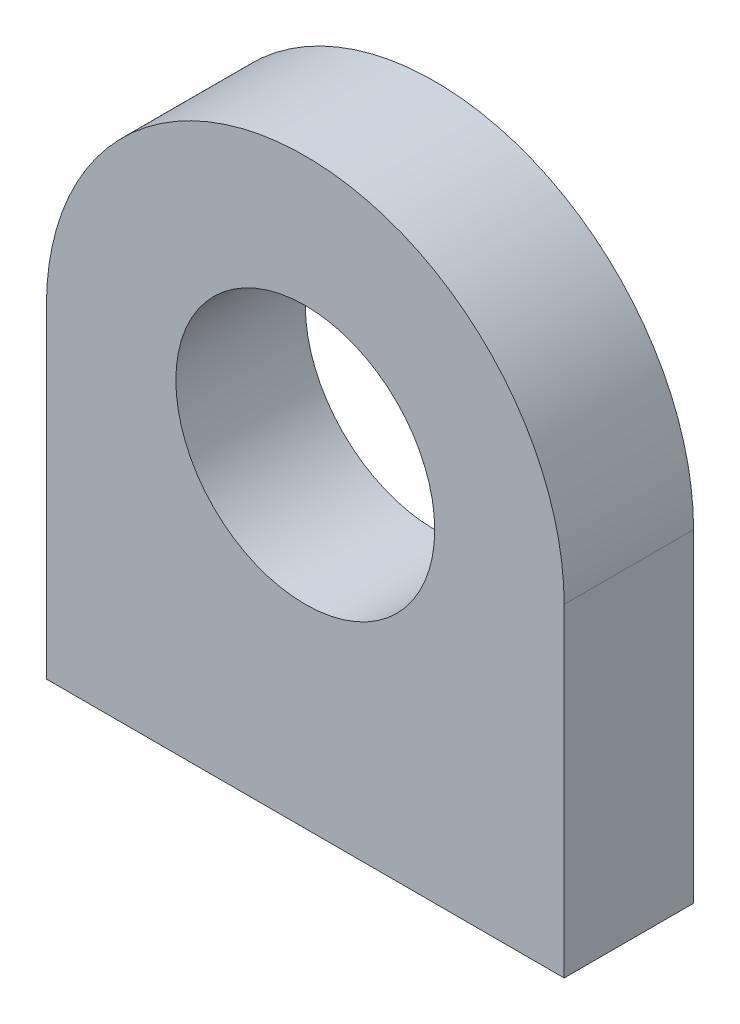
ISO-10303-21;
HEADER;
FILE_DESCRIPTION(('STEP AP214'),'2;1');
FILE_NAME('part.step','',(''),(''),'','','');
FILE_SCHEMA(('AUTOMOTIVE_DESIGN { 1 0 10303 214 1 1 1 1 }'));
ENDSEC;
DATA;
#1=APPLICATION_CONTEXT('core data for automotive mechanical design processes');
#2=APPLICATION_PROTOCOL_DEFINITION('international standard','automotive_design',2000,#1);
#3=PRODUCT_CONTEXT('',#1,'mechanical');
#4=PRODUCT('Part','Part','',(#3));
#5=PRODUCT_RELATED_PRODUCT_CATEGORY('part','',(#4));
#6=PRODUCT_DEFINITION_FORMATION('','',#4);
#7=PRODUCT_DEFINITION_CONTEXT('part definition',#1,'design');
#8=PRODUCT_DEFINITION('design','',#6,#7);
#9=PRODUCT_DEFINITION_SHAPE('','',#8);
#10=(LENGTH_UNIT() NAMED_UNIT(*) SI_UNIT(.MILLI.,.METRE.));
#11=(NAMED_UNIT(*) PLANE_ANGLE_UNIT() SI_UNIT($,.RADIAN.));
#12=(NAMED_UNIT(*) SI_UNIT($,.STERADIAN.) SOLID_ANGLE_UNIT());
#13=UNCERTAINTY_MEASURE_WITH_UNIT(LENGTH_MEASURE(1.E-05),#10,'distance_accuracy_value','');
#14=(GEOMETRIC_REPRESENTATION_CONTEXT(3) GLOBAL_UNCERTAINTY_ASSIGNED_CONTEXT((#13)) GLOBAL_UNIT_ASSIGNED_CONTEXT((#10,
#11,#12)) REPRESENTATION_CONTEXT('',''));
#15=CARTESIAN_POINT('',(0.,0.,0.));
#16=DIRECTION('',(0.,0.,1.));
#17=DIRECTION('',(1.,0.,0.));
#18=AXIS2_PLACEMENT_3D('',#15,#16,#17);
#19=CARTESIAN_POINT('',(0.,0.,4.));
#20=DIRECTION('',(0.,0.,1.));
#21=DIRECTION('',(1.,0.,0.));
#22=AXIS2_PLACEMENT_3D('',#19,#20,#21);
#23=PLANE('',#22);
#24=CARTESIAN_POINT('',(0.,0.,4.));
#25=DIRECTION('',(0.,0.,1.));
#26=DIRECTION('',(1.,0.,0.));
#27=AXIS2_PLACEMENT_3D('',#24,#25,#26);
#28=CIRCLE('',#27,8.);
#29=CARTESIAN_POINT('',(8.,0.,4.));
#30=VERTEX_POINT('',#29);
#31=CARTESIAN_POINT('',(-8.,0.,4.));
#32=VERTEX_POINT('',#31);
#33=EDGE_CURVE('E85',#30,#32,#28,.T.);
#34=ORIENTED_EDGE('',*,*,#33,.T.);
#35=DIRECTION('',(0.,-1.,0.));
#36=VECTOR('',#35,1.);
#37=CARTESIAN_POINT('',(-8.,0.,4.));
#38=LINE('',#37,#36);
#39=CARTESIAN_POINT('',(-8.,-10.,4.));
#40=VERTEX_POINT('',#39);
#41=EDGE_CURVE('E80',#32,#40,#38,.T.);
#42=ORIENTED_EDGE('',*,*,#41,.T.);
#43=DIRECTION('',(1.,0.,0.));
#44=VECTOR('',#43,1.);
#45=CARTESIAN_POINT('',(-8.,-10.,4.));
#46=LINE('',#45,#44);
#47=CARTESIAN_POINT('',(8.,-10.,4.));
#48=VERTEX_POINT('',#47);
#49=EDGE_CURVE('E83',#40,#48,#46,.T.);
#50=ORIENTED_EDGE('',*,*,#49,.T.);
#51=DIRECTION('',(0.,1.,0.));
#52=VECTOR('',#51,1.);
#53=CARTESIAN_POINT('',(8.,-10.,4.));
#54=LINE('',#53,#52);
#55=EDGE_CURVE('E50',#48,#30,#54,.T.);
#56=ORIENTED_EDGE('',*,*,#55,.T.);
#57=EDGE_LOOP('',(#34,#42,#50,#56));
#58=FACE_BOUND('',#57,.T.);
#59=CARTESIAN_POINT('',(0.,0.,4.));
#60=DIRECTION('',(0.,0.,1.));
#61=DIRECTION('',(1.,0.,0.));
#62=AXIS2_PLACEMENT_3D('',#59,#60,#61);
#63=CIRCLE('',#62,4.);
#64=CARTESIAN_POINT('',(4.,0.,4.));
#65=VERTEX_POINT('',#64);
#66=EDGE_CURVE('E100',#65,#65,#63,.T.);
#67=ORIENTED_EDGE('',*,*,#66,.F.);
#68=EDGE_LOOP('',(#67));
#69=FACE_BOUND('',#68,.T.);
#70=ADVANCED_FACE('F33',(#58,#69),#23,.T.);
#71=CARTESIAN_POINT('',(0.,0.,0.));
#72=DIRECTION('',(0.,0.,1.));
#73=DIRECTION('',(1.,0.,0.));
#74=AXIS2_PLACEMENT_3D('',#71,#72,#73);
#75=PLANE('',#74);
#76=CARTESIAN_POINT('',(0.,0.,0.));
#77=DIRECTION('',(0.,0.,1.));
#78=DIRECTION('',(1.,0.,0.));
#79=AXIS2_PLACEMENT_3D('',#76,#77,#78);
#80=CIRCLE('',#79,8.);
#81=CARTESIAN_POINT('',(8.,0.,0.));
#82=VERTEX_POINT('',#81);
#83=CARTESIAN_POINT('',(-8.,0.,0.));
#84=VERTEX_POINT('',#83);
#85=EDGE_CURVE('E97',#82,#84,#80,.T.);
#86=ORIENTED_EDGE('',*,*,#85,.F.);
#87=DIRECTION('',(0.,1.,0.));
#88=VECTOR('',#87,1.);
#89=CARTESIAN_POINT('',(8.,-10.,0.));
#90=LINE('',#89,#88);
#91=CARTESIAN_POINT('',(8.,-10.,0.));
#92=VERTEX_POINT('',#91);
#93=EDGE_CURVE('E73',#92,#82,#90,.T.);
#94=ORIENTED_EDGE('',*,*,#93,.F.);
#95=DIRECTION('',(1.,0.,0.));
#96=VECTOR('',#95,1.);
#97=CARTESIAN_POINT('',(-8.,-10.,0.));
#98=LINE('',#97,#96);
#99=CARTESIAN_POINT('',(-8.,-10.,0.));
#100=VERTEX_POINT('',#99);
#101=EDGE_CURVE('E67',#100,#92,#98,.T.);
#102=ORIENTED_EDGE('',*,*,#101,.F.);
#103=DIRECTION('',(0.,-1.,0.));
#104=VECTOR('',#103,1.);
#105=CARTESIAN_POINT('',(-8.,0.,0.));
#106=LINE('',#105,#104);
#107=EDGE_CURVE('E89',#84,#100,#106,.T.);
#108=ORIENTED_EDGE('',*,*,#107,.F.);
#109=EDGE_LOOP('',(#86,#94,#102,#108));
#110=FACE_BOUND('',#109,.T.);
#111=CARTESIAN_POINT('',(0.,0.,0.));
#112=DIRECTION('',(0.,0.,1.));
#113=DIRECTION('',(1.,0.,0.));
#114=AXIS2_PLACEMENT_3D('',#111,#112,#113);
#115=CIRCLE('',#114,4.);
#116=CARTESIAN_POINT('',(4.,0.,0.));
#117=VERTEX_POINT('',#116);
#118=EDGE_CURVE('E112',#117,#117,#115,.T.);
#119=ORIENTED_EDGE('',*,*,#118,.T.);
#120=EDGE_LOOP('',(#119));
#121=FACE_BOUND('',#120,.T.);
#122=ADVANCED_FACE('F108',(#110,#121),#75,.F.);
#123=CARTESIAN_POINT('',(0.,0.,4.));
#124=DIRECTION('',(0.,0.,-1.));
#125=DIRECTION('',(-1.,0.,0.));
#126=AXIS2_PLACEMENT_3D('',#123,#124,#125);
#127=CYLINDRICAL_SURFACE('',#126,8.);
#128=ORIENTED_EDGE('',*,*,#85,.T.);
#129=DIRECTION('',(0.,0.,-1.));
#130=VECTOR('',#129,1.);
#131=CARTESIAN_POINT('',(-8.,0.,4.));
#132=LINE('',#131,#130);
#133=EDGE_CURVE('E11',#32,#84,#132,.T.);
#134=ORIENTED_EDGE('',*,*,#133,.F.);
#135=ORIENTED_EDGE('',*,*,#33,.F.);
#136=DIRECTION('',(0.,0.,-1.));
#137=VECTOR('',#136,1.);
#138=CARTESIAN_POINT('',(8.,0.,4.));
#139=LINE('',#138,#137);
#140=EDGE_CURVE('E93',#30,#82,#139,.T.);
#141=ORIENTED_EDGE('',*,*,#140,.T.);
#142=EDGE_LOOP('',(#128,#134,#135,#141));
#143=FACE_BOUND('',#142,.T.);
#144=ADVANCED_FACE('F35',(#143),#127,.T.);
#145=CARTESIAN_POINT('',(-8.,0.,4.));
#146=DIRECTION('',(1.,0.,0.));
#147=DIRECTION('',(0.,1.,0.));
#148=AXIS2_PLACEMENT_3D('',#145,#146,#147);
#149=PLANE('',#148);
#150=ORIENTED_EDGE('',*,*,#107,.T.);
#151=DIRECTION('',(0.,0.,-1.));
#152=VECTOR('',#151,1.);
#153=CARTESIAN_POINT('',(-8.,-10.,4.));
#154=LINE('',#153,#152);
#155=EDGE_CURVE('E42',#40,#100,#154,.T.);
#156=ORIENTED_EDGE('',*,*,#155,.F.);
#157=ORIENTED_EDGE('',*,*,#41,.F.);
#158=ORIENTED_EDGE('',*,*,#133,.T.);
#159=EDGE_LOOP('',(#150,#156,#157,#158));
#160=FACE_BOUND('',#159,.T.);
#161=ADVANCED_FACE('F88',(#160),#149,.F.);
#162=CARTESIAN_POINT('',(-8.,-10.,4.));
#163=DIRECTION('',(0.,1.,0.));
#164=DIRECTION('',(0.,0.,1.));
#165=AXIS2_PLACEMENT_3D('',#162,#163,#164);
#166=PLANE('',#165);
#167=ORIENTED_EDGE('',*,*,#101,.T.);
#168=DIRECTION('',(0.,0.,-1.));
#169=VECTOR('',#168,1.);
#170=CARTESIAN_POINT('',(8.,-10.,4.));
#171=LINE('',#170,#169);
#172=EDGE_CURVE('E90',#48,#92,#171,.T.);
#173=ORIENTED_EDGE('',*,*,#172,.F.);
#174=ORIENTED_EDGE('',*,*,#49,.F.);
#175=ORIENTED_EDGE('',*,*,#155,.T.);
#176=EDGE_LOOP('',(#167,#173,#174,#175));
#177=FACE_BOUND('',#176,.T.);
#178=ADVANCED_FACE('F91',(#177),#166,.F.);
#179=CARTESIAN_POINT('',(8.,-10.,4.));
#180=DIRECTION('',(-1.,0.,0.));
#181=DIRECTION('',(0.,-1.,0.));
#182=AXIS2_PLACEMENT_3D('',#179,#180,#181);
#183=PLANE('',#182);
#184=ORIENTED_EDGE('',*,*,#93,.T.);
#185=ORIENTED_EDGE('',*,*,#140,.F.);
#186=ORIENTED_EDGE('',*,*,#55,.F.);
#187=ORIENTED_EDGE('',*,*,#172,.T.);
#188=EDGE_LOOP('',(#184,#185,#186,#187));
#189=FACE_BOUND('',#188,.T.);
#190=ADVANCED_FACE('F105',(#189),#183,.F.);
#191=CARTESIAN_POINT('',(0.,0.,4.));
#192=DIRECTION('',(0.,0.,-1.));
#193=DIRECTION('',(-1.,0.,0.));
#194=AXIS2_PLACEMENT_3D('',#191,#192,#193);
#195=CYLINDRICAL_SURFACE('',#194,4.);
#196=ORIENTED_EDGE('',*,*,#66,.T.);
#197=EDGE_LOOP('',(#196));
#198=FACE_BOUND('',#197,.T.);
#199=ORIENTED_EDGE('',*,*,#118,.F.);
#200=EDGE_LOOP('',(#199));
#201=FACE_BOUND('',#200,.T.);
#202=ADVANCED_FACE('F118',(#198,#201),#195,.F.);
#203=CLOSED_SHELL('',(#70,#122,#144,#161,#178,#190,#202));
#204=MANIFOLD_SOLID_BREP('B2',#203);
#205=ADVANCED_BREP_SHAPE_REPRESENTATION('',(#18,#204),#14);
#206=SHAPE_DEFINITION_REPRESENTATION(#9,#205);
ENDSEC;
END-ISO-10303-21;
